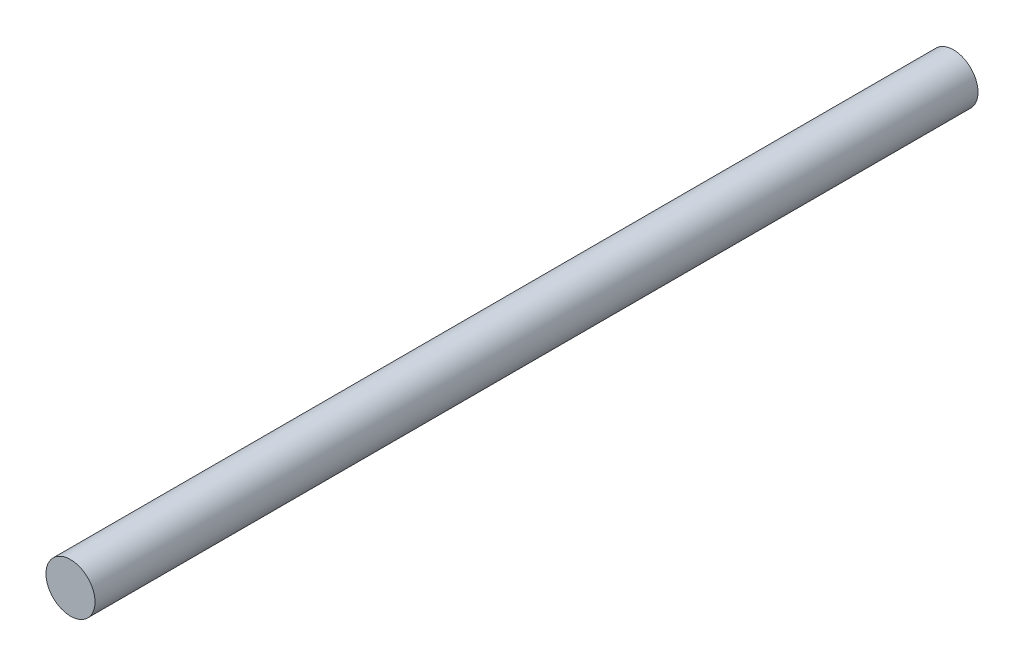
ISO-10303-21;
HEADER;
FILE_DESCRIPTION(('STEP AP214'),'2;1');
FILE_NAME('part.step','',(''),(''),'','','');
FILE_SCHEMA(('AUTOMOTIVE_DESIGN { 1 0 10303 214 1 1 1 1 }'));
ENDSEC;
DATA;
#1=APPLICATION_CONTEXT('core data for automotive mechanical design processes');
#2=APPLICATION_PROTOCOL_DEFINITION('international standard','automotive_design',2000,#1);
#3=PRODUCT_CONTEXT('',#1,'mechanical');
#4=PRODUCT('Part','Part','',(#3));
#5=PRODUCT_RELATED_PRODUCT_CATEGORY('part','',(#4));
#6=PRODUCT_DEFINITION_FORMATION('','',#4);
#7=PRODUCT_DEFINITION_CONTEXT('part definition',#1,'design');
#8=PRODUCT_DEFINITION('design','',#6,#7);
#9=PRODUCT_DEFINITION_SHAPE('','',#8);
#10=(LENGTH_UNIT() NAMED_UNIT(*) SI_UNIT(.MILLI.,.METRE.));
#11=(NAMED_UNIT(*) PLANE_ANGLE_UNIT() SI_UNIT($,.RADIAN.));
#12=(NAMED_UNIT(*) SI_UNIT($,.STERADIAN.) SOLID_ANGLE_UNIT());
#13=UNCERTAINTY_MEASURE_WITH_UNIT(LENGTH_MEASURE(1.E-05),#10,'distance_accuracy_value','');
#14=(GEOMETRIC_REPRESENTATION_CONTEXT(3) GLOBAL_UNCERTAINTY_ASSIGNED_CONTEXT((#13)) GLOBAL_UNIT_ASSIGNED_CONTEXT((#10,
#11,#12)) REPRESENTATION_CONTEXT('',''));
#15=CARTESIAN_POINT('',(0.,0.,0.));
#16=DIRECTION('',(0.,0.,1.));
#17=DIRECTION('',(1.,0.,0.));
#18=AXIS2_PLACEMENT_3D('',#15,#16,#17);
#19=CARTESIAN_POINT('',(0.,0.,180.));
#20=DIRECTION('',(0.,0.,-1.));
#21=DIRECTION('',(-1.,0.,0.));
#22=AXIS2_PLACEMENT_3D('',#19,#20,#21);
#23=CYLINDRICAL_SURFACE('',#22,9.99999999999999);
#24=CARTESIAN_POINT('',(0.,0.,180.));
#25=DIRECTION('',(0.,0.,1.));
#26=DIRECTION('',(1.,0.,0.));
#27=AXIS2_PLACEMENT_3D('',#24,#25,#26);
#28=CIRCLE('',#27,9.99999999999999);
#29=CARTESIAN_POINT('',(9.99999999999999,0.,180.));
#30=VERTEX_POINT('',#29);
#31=EDGE_CURVE('E10',#30,#30,#28,.T.);
#32=ORIENTED_EDGE('',*,*,#31,.F.);
#33=EDGE_LOOP('',(#32));
#34=FACE_BOUND('',#33,.T.);
#35=CARTESIAN_POINT('',(0.,0.,-180.));
#36=DIRECTION('',(0.,0.,1.));
#37=DIRECTION('',(1.,0.,0.));
#38=AXIS2_PLACEMENT_3D('',#35,#36,#37);
#39=CIRCLE('',#38,9.99999999999999);
#40=CARTESIAN_POINT('',(9.99999999999999,0.,-180.));
#41=VERTEX_POINT('',#40);
#42=EDGE_CURVE('E44',#41,#41,#39,.T.);
#43=ORIENTED_EDGE('',*,*,#42,.T.);
#44=EDGE_LOOP('',(#43));
#45=FACE_BOUND('',#44,.T.);
#46=ADVANCED_FACE('F41',(#34,#45),#23,.T.);
#47=CARTESIAN_POINT('',(0.,0.,180.));
#48=DIRECTION('',(0.,0.,1.));
#49=DIRECTION('',(1.,0.,0.));
#50=AXIS2_PLACEMENT_3D('',#47,#48,#49);
#51=PLANE('',#50);
#52=ORIENTED_EDGE('',*,*,#31,.T.);
#53=EDGE_LOOP('',(#52));
#54=FACE_BOUND('',#53,.T.);
#55=ADVANCED_FACE('F58',(#54),#51,.T.);
#56=CARTESIAN_POINT('',(0.,0.,-180.));
#57=DIRECTION('',(0.,0.,1.));
#58=DIRECTION('',(1.,0.,0.));
#59=AXIS2_PLACEMENT_3D('',#56,#57,#58);
#60=PLANE('',#59);
#61=ORIENTED_EDGE('',*,*,#42,.F.);
#62=EDGE_LOOP('',(#61));
#63=FACE_BOUND('',#62,.T.);
#64=ADVANCED_FACE('F56',(#63),#60,.F.);
#65=CLOSED_SHELL('',(#46,#55,#64));
#66=MANIFOLD_SOLID_BREP('B2',#65);
#67=ADVANCED_BREP_SHAPE_REPRESENTATION('',(#18,#66),#14);
#68=SHAPE_DEFINITION_REPRESENTATION(#9,#67);
ENDSEC;
END-ISO-10303-21;
